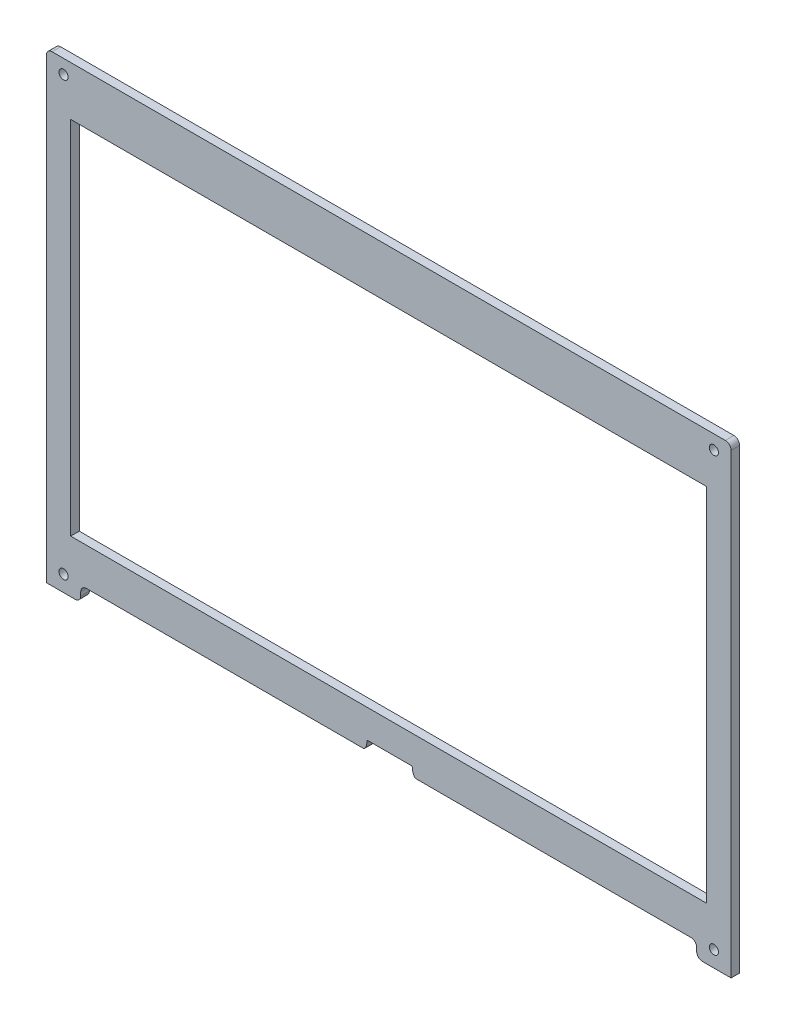
ISO-10303-21;
HEADER;
FILE_DESCRIPTION(('STEP AP214'),'2;1');
FILE_NAME('part.step','',(''),(''),'','','');
FILE_SCHEMA(('AUTOMOTIVE_DESIGN { 1 0 10303 214 1 1 1 1 }'));
ENDSEC;
DATA;
#1=APPLICATION_CONTEXT('core data for automotive mechanical design processes');
#2=APPLICATION_PROTOCOL_DEFINITION('international standard','automotive_design',2000,#1);
#3=PRODUCT_CONTEXT('',#1,'mechanical');
#4=PRODUCT('Part','Part','',(#3));
#5=PRODUCT_RELATED_PRODUCT_CATEGORY('part','',(#4));
#6=PRODUCT_DEFINITION_FORMATION('','',#4);
#7=PRODUCT_DEFINITION_CONTEXT('part definition',#1,'design');
#8=PRODUCT_DEFINITION('design','',#6,#7);
#9=PRODUCT_DEFINITION_SHAPE('','',#8);
#10=(LENGTH_UNIT() NAMED_UNIT(*) SI_UNIT(.MILLI.,.METRE.));
#11=(NAMED_UNIT(*) PLANE_ANGLE_UNIT() SI_UNIT($,.RADIAN.));
#12=(NAMED_UNIT(*) SI_UNIT($,.STERADIAN.) SOLID_ANGLE_UNIT());
#13=UNCERTAINTY_MEASURE_WITH_UNIT(LENGTH_MEASURE(1.E-05),#10,'distance_accuracy_value','');
#14=(GEOMETRIC_REPRESENTATION_CONTEXT(3) GLOBAL_UNCERTAINTY_ASSIGNED_CONTEXT((#13)) GLOBAL_UNIT_ASSIGNED_CONTEXT((#10,
#11,#12)) REPRESENTATION_CONTEXT('',''));
#15=CARTESIAN_POINT('',(0.,0.,0.));
#16=DIRECTION('',(0.,0.,1.));
#17=DIRECTION('',(1.,0.,0.));
#18=AXIS2_PLACEMENT_3D('',#15,#16,#17);
#19=CARTESIAN_POINT('',(0.,-61.264087445583,3.));
#20=DIRECTION('',(0.,1.,0.));
#21=DIRECTION('',(0.,0.,1.));
#22=AXIS2_PLACEMENT_3D('',#19,#20,#21);
#23=PLANE('',#22);
#24=DIRECTION('',(1.,0.,0.));
#25=VECTOR('',#24,1.);
#26=CARTESIAN_POINT('',(0.,-61.264087445583,0.));
#27=LINE('',#26,#25);
#28=CARTESIAN_POINT('',(-110.99866899052,-61.264087445583,0.));
#29=VERTEX_POINT('',#28);
#30=CARTESIAN_POINT('',(111.017027096704,-61.264087445583,0.));
#31=VERTEX_POINT('',#30);
#32=EDGE_CURVE('E333',#29,#31,#27,.T.);
#33=ORIENTED_EDGE('',*,*,#32,.F.);
#34=DIRECTION('',(0.,0.,-1.));
#35=VECTOR('',#34,1.);
#36=CARTESIAN_POINT('',(-110.99866899052,-61.264087445583,3.));
#37=LINE('',#36,#35);
#38=CARTESIAN_POINT('',(-110.99866899052,-61.264087445583,3.));
#39=VERTEX_POINT('',#38);
#40=EDGE_CURVE('E11',#39,#29,#37,.T.);
#41=ORIENTED_EDGE('',*,*,#40,.F.);
#42=DIRECTION('',(1.,0.,0.));
#43=VECTOR('',#42,1.);
#44=CARTESIAN_POINT('',(0.,-61.264087445583,3.));
#45=LINE('',#44,#43);
#46=CARTESIAN_POINT('',(111.017027096704,-61.264087445583,3.));
#47=VERTEX_POINT('',#46);
#48=EDGE_CURVE('E248',#39,#47,#45,.T.);
#49=ORIENTED_EDGE('',*,*,#48,.T.);
#50=DIRECTION('',(0.,0.,-1.));
#51=VECTOR('',#50,1.);
#52=CARTESIAN_POINT('',(111.017027096704,-61.264087445583,3.));
#53=LINE('',#52,#51);
#54=EDGE_CURVE('E149',#47,#31,#53,.T.);
#55=ORIENTED_EDGE('',*,*,#54,.T.);
#56=EDGE_LOOP('',(#33,#41,#49,#55));
#57=FACE_BOUND('',#56,.T.);
#58=ADVANCED_FACE('F35',(#57),#23,.T.);
#59=CARTESIAN_POINT('',(-110.99866899052,0.,3.));
#60=DIRECTION('',(1.,0.,0.));
#61=DIRECTION('',(0.,0.,-1.));
#62=AXIS2_PLACEMENT_3D('',#59,#60,#61);
#63=PLANE('',#62);
#64=DIRECTION('',(0.,-1.,0.));
#65=VECTOR('',#64,1.);
#66=CARTESIAN_POINT('',(-110.99866899052,0.,0.));
#67=LINE('',#66,#65);
#68=CARTESIAN_POINT('',(-110.99866899052,64.7082535301475,0.));
#69=VERTEX_POINT('',#68);
#70=EDGE_CURVE('E238',#69,#29,#67,.T.);
#71=ORIENTED_EDGE('',*,*,#70,.F.);
#72=DIRECTION('',(0.,0.,-1.));
#73=VECTOR('',#72,1.);
#74=CARTESIAN_POINT('',(-110.99866899052,64.7082535301475,3.));
#75=LINE('',#74,#73);
#76=CARTESIAN_POINT('',(-110.99866899052,64.7082535301475,3.));
#77=VERTEX_POINT('',#76);
#78=EDGE_CURVE('E45',#77,#69,#75,.T.);
#79=ORIENTED_EDGE('',*,*,#78,.F.);
#80=DIRECTION('',(0.,-1.,0.));
#81=VECTOR('',#80,1.);
#82=CARTESIAN_POINT('',(-110.99866899052,0.,3.));
#83=LINE('',#82,#81);
#84=EDGE_CURVE('E236',#77,#39,#83,.T.);
#85=ORIENTED_EDGE('',*,*,#84,.T.);
#86=ORIENTED_EDGE('',*,*,#40,.T.);
#87=EDGE_LOOP('',(#71,#79,#85,#86));
#88=FACE_BOUND('',#87,.T.);
#89=ADVANCED_FACE('F234',(#88),#63,.T.);
#90=CARTESIAN_POINT('',(0.,64.7082535301475,3.));
#91=DIRECTION('',(0.,1.,0.));
#92=DIRECTION('',(0.,0.,1.));
#93=AXIS2_PLACEMENT_3D('',#90,#91,#92);
#94=PLANE('',#93);
#95=DIRECTION('',(1.,0.,0.));
#96=VECTOR('',#95,1.);
#97=CARTESIAN_POINT('',(0.,64.7082535301475,0.));
#98=LINE('',#97,#96);
#99=CARTESIAN_POINT('',(111.017027096704,64.7082535301475,0.));
#100=VERTEX_POINT('',#99);
#101=EDGE_CURVE('E336',#69,#100,#98,.T.);
#102=ORIENTED_EDGE('',*,*,#101,.T.);
#103=DIRECTION('',(0.,0.,-1.));
#104=VECTOR('',#103,1.);
#105=CARTESIAN_POINT('',(111.017027096704,64.7082535301475,3.));
#106=LINE('',#105,#104);
#107=CARTESIAN_POINT('',(111.017027096704,64.7082535301475,3.));
#108=VERTEX_POINT('',#107);
#109=EDGE_CURVE('E241',#108,#100,#106,.T.);
#110=ORIENTED_EDGE('',*,*,#109,.F.);
#111=DIRECTION('',(1.,0.,0.));
#112=VECTOR('',#111,1.);
#113=CARTESIAN_POINT('',(0.,64.7082535301475,3.));
#114=LINE('',#113,#112);
#115=EDGE_CURVE('E244',#77,#108,#114,.T.);
#116=ORIENTED_EDGE('',*,*,#115,.F.);
#117=ORIENTED_EDGE('',*,*,#78,.T.);
#118=EDGE_LOOP('',(#102,#110,#116,#117));
#119=FACE_BOUND('',#118,.T.);
#120=ADVANCED_FACE('F245',(#119),#94,.F.);
#121=CARTESIAN_POINT('',(105.5,-76.3425603634929,3.));
#122=DIRECTION('',(0.,0.,-1.));
#123=DIRECTION('',(-1.,0.,0.));
#124=AXIS2_PLACEMENT_3D('',#121,#122,#123);
#125=CYLINDRICAL_SURFACE('',#124,2.);
#126=CARTESIAN_POINT('',(105.5,-76.3425603634929,0.));
#127=DIRECTION('',(0.,0.,1.));
#128=DIRECTION('',(1.,0.,0.));
#129=AXIS2_PLACEMENT_3D('',#126,#127,#128);
#130=CIRCLE('',#129,2.);
#131=CARTESIAN_POINT('',(105.5,-74.3425603634929,0.));
#132=VERTEX_POINT('',#131);
#133=CARTESIAN_POINT('',(107.5,-76.3425603634929,0.));
#134=VERTEX_POINT('',#133);
#135=EDGE_CURVE('E256',#132,#134,#130,.F.);
#136=ORIENTED_EDGE('',*,*,#135,.T.);
#137=DIRECTION('',(0.,0.,-1.));
#138=VECTOR('',#137,1.);
#139=CARTESIAN_POINT('',(107.5,-76.3425603634929,3.));
#140=LINE('',#139,#138);
#141=CARTESIAN_POINT('',(107.5,-76.3425603634929,3.));
#142=VERTEX_POINT('',#141);
#143=EDGE_CURVE('E39',#142,#134,#140,.T.);
#144=ORIENTED_EDGE('',*,*,#143,.F.);
#145=CARTESIAN_POINT('',(105.5,-76.3425603634929,3.));
#146=DIRECTION('',(0.,0.,1.));
#147=DIRECTION('',(1.,0.,0.));
#148=AXIS2_PLACEMENT_3D('',#145,#146,#147);
#149=CIRCLE('',#148,2.);
#150=CARTESIAN_POINT('',(105.5,-74.3425603634929,3.));
#151=VERTEX_POINT('',#150);
#152=EDGE_CURVE('E339',#151,#142,#149,.F.);
#153=ORIENTED_EDGE('',*,*,#152,.F.);
#154=DIRECTION('',(0.,0.,-1.));
#155=VECTOR('',#154,1.);
#156=CARTESIAN_POINT('',(105.5,-74.3425603634929,3.));
#157=LINE('',#156,#155);
#158=EDGE_CURVE('E255',#151,#132,#157,.T.);
#159=ORIENTED_EDGE('',*,*,#158,.T.);
#160=EDGE_LOOP('',(#136,#144,#153,#159));
#161=FACE_BOUND('',#160,.T.);
#162=ADVANCED_FACE('F37',(#161),#125,.F.);
#163=CARTESIAN_POINT('',(107.5,0.,3.));
#164=DIRECTION('',(1.,0.,0.));
#165=DIRECTION('',(0.,0.,-1.));
#166=AXIS2_PLACEMENT_3D('',#163,#164,#165);
#167=PLANE('',#166);
#168=DIRECTION('',(0.,-1.,0.));
#169=VECTOR('',#168,1.);
#170=CARTESIAN_POINT('',(107.5,0.,0.));
#171=LINE('',#170,#169);
#172=CARTESIAN_POINT('',(107.5,-77.5888337628124,0.));
#173=VERTEX_POINT('',#172);
#174=EDGE_CURVE('E259',#134,#173,#171,.T.);
#175=ORIENTED_EDGE('',*,*,#174,.T.);
#176=DIRECTION('',(0.,0.,-1.));
#177=VECTOR('',#176,1.);
#178=CARTESIAN_POINT('',(107.5,-77.5888337628124,3.));
#179=LINE('',#178,#177);
#180=CARTESIAN_POINT('',(107.5,-77.5888337628124,3.));
#181=VERTEX_POINT('',#180);
#182=EDGE_CURVE('E390',#181,#173,#179,.T.);
#183=ORIENTED_EDGE('',*,*,#182,.F.);
#184=DIRECTION('',(0.,-1.,0.));
#185=VECTOR('',#184,1.);
#186=CARTESIAN_POINT('',(107.5,0.,3.));
#187=LINE('',#186,#185);
#188=EDGE_CURVE('E157',#142,#181,#187,.T.);
#189=ORIENTED_EDGE('',*,*,#188,.F.);
#190=ORIENTED_EDGE('',*,*,#143,.T.);
#191=EDGE_LOOP('',(#175,#183,#189,#190));
#192=FACE_BOUND('',#191,.T.);
#193=ADVANCED_FACE('F396',(#192),#167,.F.);
#194=CARTESIAN_POINT('',(109.5,-77.5888337628124,3.));
#195=DIRECTION('',(0.,0.,-1.));
#196=DIRECTION('',(-1.,0.,0.));
#197=AXIS2_PLACEMENT_3D('',#194,#195,#196);
#198=CYLINDRICAL_SURFACE('',#197,2.);
#199=CARTESIAN_POINT('',(109.5,-77.5888337628124,0.));
#200=DIRECTION('',(0.,0.,1.));
#201=DIRECTION('',(1.,0.,0.));
#202=AXIS2_PLACEMENT_3D('',#199,#200,#201);
#203=CIRCLE('',#202,2.);
#204=CARTESIAN_POINT('',(109.5,-79.5888337628124,0.));
#205=VERTEX_POINT('',#204);
#206=EDGE_CURVE('E261',#173,#205,#203,.T.);
#207=ORIENTED_EDGE('',*,*,#206,.T.);
#208=DIRECTION('',(0.,0.,-1.));
#209=VECTOR('',#208,1.);
#210=CARTESIAN_POINT('',(109.5,-79.5888337628124,3.));
#211=LINE('',#210,#209);
#212=CARTESIAN_POINT('',(109.5,-79.5888337628124,3.));
#213=VERTEX_POINT('',#212);
#214=EDGE_CURVE('E389',#213,#205,#211,.T.);
#215=ORIENTED_EDGE('',*,*,#214,.F.);
#216=CARTESIAN_POINT('',(109.5,-77.5888337628124,3.));
#217=DIRECTION('',(0.,0.,1.));
#218=DIRECTION('',(1.,0.,0.));
#219=AXIS2_PLACEMENT_3D('',#216,#217,#218);
#220=CIRCLE('',#219,2.);
#221=EDGE_CURVE('E410',#181,#213,#220,.T.);
#222=ORIENTED_EDGE('',*,*,#221,.F.);
#223=ORIENTED_EDGE('',*,*,#182,.T.);
#224=EDGE_LOOP('',(#207,#215,#222,#223));
#225=FACE_BOUND('',#224,.T.);
#226=ADVANCED_FACE('F408',(#225),#198,.T.);
#227=CARTESIAN_POINT('',(0.,-79.5888337628124,3.));
#228=DIRECTION('',(0.,-1.,0.));
#229=DIRECTION('',(0.,0.,-1.));
#230=AXIS2_PLACEMENT_3D('',#227,#228,#229);
#231=PLANE('',#230);
#232=DIRECTION('',(-1.,0.,0.));
#233=VECTOR('',#232,1.);
#234=CARTESIAN_POINT('',(0.,-79.5888337628124,0.));
#235=LINE('',#234,#233);
#236=CARTESIAN_POINT('',(119.500003052676,-79.5888337628124,0.));
#237=VERTEX_POINT('',#236);
#238=EDGE_CURVE('E264',#237,#205,#235,.T.);
#239=ORIENTED_EDGE('',*,*,#238,.F.);
#240=DIRECTION('',(0.,0.,-1.));
#241=VECTOR('',#240,1.);
#242=CARTESIAN_POINT('',(119.500003052676,-79.5888337628124,3.));
#243=LINE('',#242,#241);
#244=CARTESIAN_POINT('',(119.500003052676,-79.5888337628124,3.));
#245=VERTEX_POINT('',#244);
#246=EDGE_CURVE('E387',#245,#237,#243,.T.);
#247=ORIENTED_EDGE('',*,*,#246,.F.);
#248=DIRECTION('',(-1.,0.,0.));
#249=VECTOR('',#248,1.);
#250=CARTESIAN_POINT('',(0.,-79.5888337628124,3.));
#251=LINE('',#250,#249);
#252=EDGE_CURVE('E413',#245,#213,#251,.T.);
#253=ORIENTED_EDGE('',*,*,#252,.T.);
#254=ORIENTED_EDGE('',*,*,#214,.T.);
#255=EDGE_LOOP('',(#239,#247,#253,#254));
#256=FACE_BOUND('',#255,.T.);
#257=ADVANCED_FACE('F414',(#256),#231,.T.);
#258=CARTESIAN_POINT('',(119.500003052676,0.,3.));
#259=DIRECTION('',(1.,0.,0.));
#260=DIRECTION('',(0.,0.,-1.));
#261=AXIS2_PLACEMENT_3D('',#258,#259,#260);
#262=PLANE('',#261);
#263=DIRECTION('',(0.,-1.,0.));
#264=VECTOR('',#263,1.);
#265=CARTESIAN_POINT('',(119.500003052676,0.,0.));
#266=LINE('',#265,#264);
#267=CARTESIAN_POINT('',(119.500003052676,79.9103462304699,0.));
#268=VERTEX_POINT('',#267);
#269=EDGE_CURVE('E267',#268,#237,#266,.T.);
#270=ORIENTED_EDGE('',*,*,#269,.F.);
#271=DIRECTION('',(0.,0.,-1.));
#272=VECTOR('',#271,1.);
#273=CARTESIAN_POINT('',(119.500003052676,79.9103462304699,3.));
#274=LINE('',#273,#272);
#275=CARTESIAN_POINT('',(119.500003052676,79.9103462304699,3.));
#276=VERTEX_POINT('',#275);
#277=EDGE_CURVE('E385',#276,#268,#274,.T.);
#278=ORIENTED_EDGE('',*,*,#277,.F.);
#279=DIRECTION('',(0.,-1.,0.));
#280=VECTOR('',#279,1.);
#281=CARTESIAN_POINT('',(119.500003052676,0.,3.));
#282=LINE('',#281,#280);
#283=EDGE_CURVE('E418',#276,#245,#282,.T.);
#284=ORIENTED_EDGE('',*,*,#283,.T.);
#285=ORIENTED_EDGE('',*,*,#246,.T.);
#286=EDGE_LOOP('',(#270,#278,#284,#285));
#287=FACE_BOUND('',#286,.T.);
#288=ADVANCED_FACE('F594',(#287),#262,.T.);
#289=CARTESIAN_POINT('',(117.494841083084,79.9103462304699,3.));
#290=DIRECTION('',(0.,0.,-1.));
#291=DIRECTION('',(-1.,0.,0.));
#292=AXIS2_PLACEMENT_3D('',#289,#290,#291);
#293=CYLINDRICAL_SURFACE('',#292,2.00516196959211);
#294=CARTESIAN_POINT('',(117.494841083084,79.9103462304699,0.));
#295=DIRECTION('',(0.,0.,1.));
#296=DIRECTION('',(1.,0.,0.));
#297=AXIS2_PLACEMENT_3D('',#294,#295,#296);
#298=CIRCLE('',#297,2.00516196959211);
#299=CARTESIAN_POINT('',(117.494826949063,81.9155082000122,0.));
#300=VERTEX_POINT('',#299);
#301=EDGE_CURVE('E270',#300,#268,#298,.F.);
#302=ORIENTED_EDGE('',*,*,#301,.F.);
#303=DIRECTION('',(0.,0.,-1.));
#304=VECTOR('',#303,1.);
#305=CARTESIAN_POINT('',(117.494826949063,81.9155082000122,3.));
#306=LINE('',#305,#304);
#307=CARTESIAN_POINT('',(117.494826949063,81.9155082000122,3.));
#308=VERTEX_POINT('',#307);
#309=EDGE_CURVE('E383',#308,#300,#306,.T.);
#310=ORIENTED_EDGE('',*,*,#309,.F.);
#311=CARTESIAN_POINT('',(117.494841083084,79.9103462304699,3.));
#312=DIRECTION('',(0.,0.,1.));
#313=DIRECTION('',(1.,0.,0.));
#314=AXIS2_PLACEMENT_3D('',#311,#312,#313);
#315=CIRCLE('',#314,2.00516196959211);
#316=EDGE_CURVE('E420',#308,#276,#315,.F.);
#317=ORIENTED_EDGE('',*,*,#316,.T.);
#318=ORIENTED_EDGE('',*,*,#277,.T.);
#319=EDGE_LOOP('',(#302,#310,#317,#318));
#320=FACE_BOUND('',#319,.T.);
#321=ADVANCED_FACE('F590',(#320),#293,.T.);
#322=CARTESIAN_POINT('',(-0.000577401628049426,81.9146799963524,3.));
#323=DIRECTION('',(-7.04881747765838E-06,0.999999999975157,0.));
#324=DIRECTION('',(-0.999999999975157,-7.04881747765838E-06,0.));
#325=AXIS2_PLACEMENT_3D('',#322,#323,#324);
#326=PLANE('',#325);
#327=DIRECTION('',(0.999999999975157,7.04881747765838E-06,0.));
#328=VECTOR('',#327,1.);
#329=CARTESIAN_POINT('',(-0.000577401628049426,81.9146799963524,0.));
#330=LINE('',#329,#328);
#331=CARTESIAN_POINT('',(-117.5,81.9138517643688,0.));
#332=VERTEX_POINT('',#331);
#333=EDGE_CURVE('E273',#332,#300,#330,.T.);
#334=ORIENTED_EDGE('',*,*,#333,.F.);
#335=DIRECTION('',(0.,0.,-1.));
#336=VECTOR('',#335,1.);
#337=CARTESIAN_POINT('',(-117.5,81.9138517643688,3.));
#338=LINE('',#337,#336);
#339=CARTESIAN_POINT('',(-117.5,81.9138517643688,3.));
#340=VERTEX_POINT('',#339);
#341=EDGE_CURVE('E381',#340,#332,#338,.T.);
#342=ORIENTED_EDGE('',*,*,#341,.F.);
#343=DIRECTION('',(0.999999999975157,7.04881747765838E-06,0.));
#344=VECTOR('',#343,1.);
#345=CARTESIAN_POINT('',(-0.000577401628049426,81.9146799963524,3.));
#346=LINE('',#345,#344);
#347=EDGE_CURVE('E427',#340,#308,#346,.T.);
#348=ORIENTED_EDGE('',*,*,#347,.T.);
#349=ORIENTED_EDGE('',*,*,#309,.T.);
#350=EDGE_LOOP('',(#334,#342,#348,#349));
#351=FACE_BOUND('',#350,.T.);
#352=ADVANCED_FACE('F586',(#351),#326,.T.);
#353=CARTESIAN_POINT('',(-117.5,79.9138517643688,3.));
#354=DIRECTION('',(0.,0.,-1.));
#355=DIRECTION('',(-1.,0.,0.));
#356=AXIS2_PLACEMENT_3D('',#353,#354,#355);
#357=CYLINDRICAL_SURFACE('',#356,2.);
#358=CARTESIAN_POINT('',(-117.5,79.9138517643688,0.));
#359=DIRECTION('',(0.,0.,1.));
#360=DIRECTION('',(1.,0.,0.));
#361=AXIS2_PLACEMENT_3D('',#358,#359,#360);
#362=CIRCLE('',#361,2.);
#363=CARTESIAN_POINT('',(-119.5,79.9138517643688,0.));
#364=VERTEX_POINT('',#363);
#365=EDGE_CURVE('E276',#364,#332,#362,.F.);
#366=ORIENTED_EDGE('',*,*,#365,.F.);
#367=DIRECTION('',(0.,0.,-1.));
#368=VECTOR('',#367,1.);
#369=CARTESIAN_POINT('',(-119.5,79.9138517643688,3.));
#370=LINE('',#369,#368);
#371=CARTESIAN_POINT('',(-119.5,79.9138517643688,3.));
#372=VERTEX_POINT('',#371);
#373=EDGE_CURVE('E379',#372,#364,#370,.T.);
#374=ORIENTED_EDGE('',*,*,#373,.F.);
#375=CARTESIAN_POINT('',(-117.5,79.9138517643688,3.));
#376=DIRECTION('',(0.,0.,1.));
#377=DIRECTION('',(1.,0.,0.));
#378=AXIS2_PLACEMENT_3D('',#375,#376,#377);
#379=CIRCLE('',#378,2.);
#380=EDGE_CURVE('E430',#372,#340,#379,.F.);
#381=ORIENTED_EDGE('',*,*,#380,.T.);
#382=ORIENTED_EDGE('',*,*,#341,.T.);
#383=EDGE_LOOP('',(#366,#374,#381,#382));
#384=FACE_BOUND('',#383,.T.);
#385=ADVANCED_FACE('F582',(#384),#357,.T.);
#386=CARTESIAN_POINT('',(-119.5,0.,3.));
#387=DIRECTION('',(1.,0.,0.));
#388=DIRECTION('',(0.,0.,-1.));
#389=AXIS2_PLACEMENT_3D('',#386,#387,#388);
#390=PLANE('',#389);
#391=DIRECTION('',(0.,-1.,0.));
#392=VECTOR('',#391,1.);
#393=CARTESIAN_POINT('',(-119.5,0.,0.));
#394=LINE('',#393,#392);
#395=CARTESIAN_POINT('',(-119.5,-79.5888337628125,0.));
#396=VERTEX_POINT('',#395);
#397=EDGE_CURVE('E279',#364,#396,#394,.T.);
#398=ORIENTED_EDGE('',*,*,#397,.T.);
#399=DIRECTION('',(0.,0.,-1.));
#400=VECTOR('',#399,1.);
#401=CARTESIAN_POINT('',(-119.5,-79.5888337628125,3.));
#402=LINE('',#401,#400);
#403=CARTESIAN_POINT('',(-119.5,-79.5888337628125,3.));
#404=VERTEX_POINT('',#403);
#405=EDGE_CURVE('E376',#404,#396,#402,.T.);
#406=ORIENTED_EDGE('',*,*,#405,.F.);
#407=DIRECTION('',(0.,-1.,0.));
#408=VECTOR('',#407,1.);
#409=CARTESIAN_POINT('',(-119.5,0.,3.));
#410=LINE('',#409,#408);
#411=EDGE_CURVE('E433',#372,#404,#410,.T.);
#412=ORIENTED_EDGE('',*,*,#411,.F.);
#413=ORIENTED_EDGE('',*,*,#373,.T.);
#414=EDGE_LOOP('',(#398,#406,#412,#413));
#415=FACE_BOUND('',#414,.T.);
#416=ADVANCED_FACE('F578',(#415),#390,.F.);
#417=CARTESIAN_POINT('',(0.,-79.5888337628125,3.));
#418=DIRECTION('',(0.,1.,0.));
#419=DIRECTION('',(0.,0.,1.));
#420=AXIS2_PLACEMENT_3D('',#417,#418,#419);
#421=PLANE('',#420);
#422=DIRECTION('',(1.,0.,0.));
#423=VECTOR('',#422,1.);
#424=CARTESIAN_POINT('',(0.,-79.5888337628125,0.));
#425=LINE('',#424,#423);
#426=CARTESIAN_POINT('',(-109.5,-79.5888337628125,0.));
#427=VERTEX_POINT('',#426);
#428=EDGE_CURVE('E281',#396,#427,#425,.T.);
#429=ORIENTED_EDGE('',*,*,#428,.T.);
#430=DIRECTION('',(0.,0.,-1.));
#431=VECTOR('',#430,1.);
#432=CARTESIAN_POINT('',(-109.5,-79.5888337628125,3.));
#433=LINE('',#432,#431);
#434=CARTESIAN_POINT('',(-109.5,-79.5888337628125,3.));
#435=VERTEX_POINT('',#434);
#436=EDGE_CURVE('E373',#435,#427,#433,.T.);
#437=ORIENTED_EDGE('',*,*,#436,.F.);
#438=DIRECTION('',(1.,0.,0.));
#439=VECTOR('',#438,1.);
#440=CARTESIAN_POINT('',(0.,-79.5888337628125,3.));
#441=LINE('',#440,#439);
#442=EDGE_CURVE('E435',#404,#435,#441,.T.);
#443=ORIENTED_EDGE('',*,*,#442,.F.);
#444=ORIENTED_EDGE('',*,*,#405,.T.);
#445=EDGE_LOOP('',(#429,#437,#443,#444));
#446=FACE_BOUND('',#445,.T.);
#447=ADVANCED_FACE('F574',(#446),#421,.F.);
#448=CARTESIAN_POINT('',(-109.5,-77.5888337628125,3.));
#449=DIRECTION('',(0.,0.,-1.));
#450=DIRECTION('',(-1.,0.,0.));
#451=AXIS2_PLACEMENT_3D('',#448,#449,#450);
#452=CYLINDRICAL_SURFACE('',#451,2.);
#453=CARTESIAN_POINT('',(-109.5,-77.5888337628125,0.));
#454=DIRECTION('',(0.,0.,1.));
#455=DIRECTION('',(1.,0.,0.));
#456=AXIS2_PLACEMENT_3D('',#453,#454,#455);
#457=CIRCLE('',#456,2.);
#458=CARTESIAN_POINT('',(-107.5,-77.5888337628125,0.));
#459=VERTEX_POINT('',#458);
#460=EDGE_CURVE('E283',#427,#459,#457,.T.);
#461=ORIENTED_EDGE('',*,*,#460,.T.);
#462=DIRECTION('',(0.,0.,-1.));
#463=VECTOR('',#462,1.);
#464=CARTESIAN_POINT('',(-107.5,-77.5888337628125,3.));
#465=LINE('',#464,#463);
#466=CARTESIAN_POINT('',(-107.5,-77.5888337628125,3.));
#467=VERTEX_POINT('',#466);
#468=EDGE_CURVE('E371',#467,#459,#465,.T.);
#469=ORIENTED_EDGE('',*,*,#468,.F.);
#470=CARTESIAN_POINT('',(-109.5,-77.5888337628125,3.));
#471=DIRECTION('',(0.,0.,1.));
#472=DIRECTION('',(1.,0.,0.));
#473=AXIS2_PLACEMENT_3D('',#470,#471,#472);
#474=CIRCLE('',#473,2.);
#475=EDGE_CURVE('E437',#435,#467,#474,.T.);
#476=ORIENTED_EDGE('',*,*,#475,.F.);
#477=ORIENTED_EDGE('',*,*,#436,.T.);
#478=EDGE_LOOP('',(#461,#469,#476,#477));
#479=FACE_BOUND('',#478,.T.);
#480=ADVANCED_FACE('F570',(#479),#452,.T.);
#481=CARTESIAN_POINT('',(-107.5,0.,3.));
#482=DIRECTION('',(1.,0.,0.));
#483=DIRECTION('',(0.,0.,-1.));
#484=AXIS2_PLACEMENT_3D('',#481,#482,#483);
#485=PLANE('',#484);
#486=DIRECTION('',(0.,-1.,0.));
#487=VECTOR('',#486,1.);
#488=CARTESIAN_POINT('',(-107.5,0.,0.));
#489=LINE('',#488,#487);
#490=CARTESIAN_POINT('',(-107.5,-76.3425603634929,0.));
#491=VERTEX_POINT('',#490);
#492=EDGE_CURVE('E286',#491,#459,#489,.T.);
#493=ORIENTED_EDGE('',*,*,#492,.F.);
#494=DIRECTION('',(0.,0.,-1.));
#495=VECTOR('',#494,1.);
#496=CARTESIAN_POINT('',(-107.5,-76.3425603634929,3.));
#497=LINE('',#496,#495);
#498=CARTESIAN_POINT('',(-107.5,-76.3425603634929,3.));
#499=VERTEX_POINT('',#498);
#500=EDGE_CURVE('E369',#499,#491,#497,.T.);
#501=ORIENTED_EDGE('',*,*,#500,.F.);
#502=DIRECTION('',(0.,-1.,0.));
#503=VECTOR('',#502,1.);
#504=CARTESIAN_POINT('',(-107.5,0.,3.));
#505=LINE('',#504,#503);
#506=EDGE_CURVE('E439',#499,#467,#505,.T.);
#507=ORIENTED_EDGE('',*,*,#506,.T.);
#508=ORIENTED_EDGE('',*,*,#468,.T.);
#509=EDGE_LOOP('',(#493,#501,#507,#508));
#510=FACE_BOUND('',#509,.T.);
#511=ADVANCED_FACE('F566',(#510),#485,.T.);
#512=CARTESIAN_POINT('',(-105.5,-76.3425603634929,3.));
#513=DIRECTION('',(0.,0.,-1.));
#514=DIRECTION('',(-1.,0.,0.));
#515=AXIS2_PLACEMENT_3D('',#512,#513,#514);
#516=CYLINDRICAL_SURFACE('',#515,2.);
#517=CARTESIAN_POINT('',(-105.5,-76.3425603634929,0.));
#518=DIRECTION('',(0.,0.,1.));
#519=DIRECTION('',(1.,0.,0.));
#520=AXIS2_PLACEMENT_3D('',#517,#518,#519);
#521=CIRCLE('',#520,2.);
#522=CARTESIAN_POINT('',(-105.5,-74.3425603634929,0.));
#523=VERTEX_POINT('',#522);
#524=EDGE_CURVE('E289',#523,#491,#521,.T.);
#525=ORIENTED_EDGE('',*,*,#524,.F.);
#526=DIRECTION('',(0.,0.,-1.));
#527=VECTOR('',#526,1.);
#528=CARTESIAN_POINT('',(-105.5,-74.3425603634929,3.));
#529=LINE('',#528,#527);
#530=CARTESIAN_POINT('',(-105.5,-74.3425603634929,3.));
#531=VERTEX_POINT('',#530);
#532=EDGE_CURVE('E367',#531,#523,#529,.T.);
#533=ORIENTED_EDGE('',*,*,#532,.F.);
#534=CARTESIAN_POINT('',(-105.5,-76.3425603634929,3.));
#535=DIRECTION('',(0.,0.,1.));
#536=DIRECTION('',(1.,0.,0.));
#537=AXIS2_PLACEMENT_3D('',#534,#535,#536);
#538=CIRCLE('',#537,2.);
#539=EDGE_CURVE('E442',#531,#499,#538,.T.);
#540=ORIENTED_EDGE('',*,*,#539,.T.);
#541=ORIENTED_EDGE('',*,*,#500,.T.);
#542=EDGE_LOOP('',(#525,#533,#540,#541));
#543=FACE_BOUND('',#542,.T.);
#544=ADVANCED_FACE('F562',(#543),#516,.F.);
#545=CARTESIAN_POINT('',(0.,-74.3425603634928,3.));
#546=DIRECTION('',(0.,-1.,0.));
#547=DIRECTION('',(1.,0.,0.));
#548=AXIS2_PLACEMENT_3D('',#545,#546,#547);
#549=PLANE('',#548);
#550=DIRECTION('',(-1.,0.,0.));
#551=VECTOR('',#550,1.);
#552=CARTESIAN_POINT('',(0.,-74.3425603634928,0.));
#553=LINE('',#552,#551);
#554=CARTESIAN_POINT('',(-8.82607722568258,-74.3425603634928,0.));
#555=VERTEX_POINT('',#554);
#556=EDGE_CURVE('E292',#555,#523,#553,.T.);
#557=ORIENTED_EDGE('',*,*,#556,.F.);
#558=DIRECTION('',(0.,0.,-1.));
#559=VECTOR('',#558,1.);
#560=CARTESIAN_POINT('',(-8.82607722568258,-74.3425603634928,3.));
#561=LINE('',#560,#559);
#562=CARTESIAN_POINT('',(-8.82607722568258,-74.3425603634928,3.));
#563=VERTEX_POINT('',#562);
#564=EDGE_CURVE('E365',#563,#555,#561,.T.);
#565=ORIENTED_EDGE('',*,*,#564,.F.);
#566=DIRECTION('',(-1.,0.,0.));
#567=VECTOR('',#566,1.);
#568=CARTESIAN_POINT('',(0.,-74.3425603634928,3.));
#569=LINE('',#568,#567);
#570=EDGE_CURVE('E445',#563,#531,#569,.T.);
#571=ORIENTED_EDGE('',*,*,#570,.T.);
#572=ORIENTED_EDGE('',*,*,#532,.T.);
#573=EDGE_LOOP('',(#557,#565,#571,#572));
#574=FACE_BOUND('',#573,.T.);
#575=ADVANCED_FACE('F558',(#574),#549,.T.);
#576=CARTESIAN_POINT('',(-8.82603130241022,-73.8425603656018,3.));
#577=DIRECTION('',(0.,0.,-1.));
#578=DIRECTION('',(-1.,0.,0.));
#579=AXIS2_PLACEMENT_3D('',#576,#577,#578);
#580=CYLINDRICAL_SURFACE('',#579,0.499999999999981);
#581=CARTESIAN_POINT('',(-8.82603130241022,-73.8425603656018,0.));
#582=DIRECTION('',(0.,0.,1.));
#583=DIRECTION('',(1.,0.,0.));
#584=AXIS2_PLACEMENT_3D('',#581,#582,#583);
#585=CIRCLE('',#584,0.499999999999981);
#586=CARTESIAN_POINT('',(-8.46060935793576,-74.1838326945364,0.));
#587=VERTEX_POINT('',#586);
#588=EDGE_CURVE('E295',#587,#555,#585,.F.);
#589=ORIENTED_EDGE('',*,*,#588,.F.);
#590=DIRECTION('',(0.,0.,-1.));
#591=VECTOR('',#590,1.);
#592=CARTESIAN_POINT('',(-8.46060935793576,-74.1838326945364,3.));
#593=LINE('',#592,#591);
#594=CARTESIAN_POINT('',(-8.46060935793576,-74.1838326945364,3.));
#595=VERTEX_POINT('',#594);
#596=EDGE_CURVE('E363',#595,#587,#593,.T.);
#597=ORIENTED_EDGE('',*,*,#596,.F.);
#598=CARTESIAN_POINT('',(-8.82603130241022,-73.8425603656018,3.));
#599=DIRECTION('',(0.,0.,1.));
#600=DIRECTION('',(1.,0.,0.));
#601=AXIS2_PLACEMENT_3D('',#598,#599,#600);
#602=CIRCLE('',#601,0.499999999999981);
#603=EDGE_CURVE('E448',#595,#563,#602,.F.);
#604=ORIENTED_EDGE('',*,*,#603,.T.);
#605=ORIENTED_EDGE('',*,*,#564,.T.);
#606=EDGE_LOOP('',(#589,#597,#604,#605));
#607=FACE_BOUND('',#606,.T.);
#608=ADVANCED_FACE('F554',(#607),#580,.T.);
#609=CARTESIAN_POINT('',(-10.633710479812,-72.1543451607771,3.));
#610=DIRECTION('',(0.,0.,-1.));
#611=DIRECTION('',(-1.,0.,0.));
#612=AXIS2_PLACEMENT_3D('',#609,#610,#611);
#613=CYLINDRICAL_SURFACE('',#612,2.9734135493712);
#614=CARTESIAN_POINT('',(-10.633710479812,-72.1543451607771,0.));
#615=DIRECTION('',(0.,0.,1.));
#616=DIRECTION('',(1.,0.,0.));
#617=AXIS2_PLACEMENT_3D('',#614,#615,#616);
#618=CIRCLE('',#617,2.9734135493712);
#619=CARTESIAN_POINT('',(-7.66137115746673,-72.2342644226863,0.));
#620=VERTEX_POINT('',#619);
#621=EDGE_CURVE('E298',#620,#587,#618,.F.);
#622=ORIENTED_EDGE('',*,*,#621,.F.);
#623=DIRECTION('',(0.,0.,-1.));
#624=VECTOR('',#623,1.);
#625=CARTESIAN_POINT('',(-7.66137115746673,-72.2342644226863,3.));
#626=LINE('',#625,#624);
#627=CARTESIAN_POINT('',(-7.66137115746673,-72.2342644226863,3.));
#628=VERTEX_POINT('',#627);
#629=EDGE_CURVE('E361',#628,#620,#626,.T.);
#630=ORIENTED_EDGE('',*,*,#629,.F.);
#631=CARTESIAN_POINT('',(-10.633710479812,-72.1543451607771,3.));
#632=DIRECTION('',(0.,0.,1.));
#633=DIRECTION('',(1.,0.,0.));
#634=AXIS2_PLACEMENT_3D('',#631,#632,#633);
#635=CIRCLE('',#634,2.9734135493712);
#636=EDGE_CURVE('E451',#628,#595,#635,.F.);
#637=ORIENTED_EDGE('',*,*,#636,.T.);
#638=ORIENTED_EDGE('',*,*,#596,.T.);
#639=EDGE_LOOP('',(#622,#630,#637,#638));
#640=FACE_BOUND('',#639,.T.);
#641=ADVANCED_FACE('F550',(#640),#613,.T.);
#642=CARTESIAN_POINT('',(-7.58675748051998,0.00783581692458199,3.));
#643=DIRECTION('',(-0.999999466633401,0.00103282762963472,0.));
#644=DIRECTION('',(-0.00103282762963473,-0.999999466633402,0.));
#645=AXIS2_PLACEMENT_3D('',#642,#643,#644);
#646=PLANE('',#645);
#647=DIRECTION('',(0.00103282762963473,0.999999466633402,0.));
#648=VECTOR('',#647,1.);
#649=CARTESIAN_POINT('',(-7.58675748051998,0.00783581692458199,0.));
#650=LINE('',#649,#648);
#651=CARTESIAN_POINT('',(-7.66081281116421,-71.6936650150983,0.));
#652=VERTEX_POINT('',#651);
#653=EDGE_CURVE('E301',#620,#652,#650,.T.);
#654=ORIENTED_EDGE('',*,*,#653,.T.);
#655=DIRECTION('',(0.,0.,-1.));
#656=VECTOR('',#655,1.);
#657=CARTESIAN_POINT('',(-7.66081281116421,-71.6936650150983,3.));
#658=LINE('',#657,#656);
#659=CARTESIAN_POINT('',(-7.66081281116421,-71.6936650150983,3.));
#660=VERTEX_POINT('',#659);
#661=EDGE_CURVE('E358',#660,#652,#658,.T.);
#662=ORIENTED_EDGE('',*,*,#661,.F.);
#663=DIRECTION('',(0.00103282762963473,0.999999466633402,0.));
#664=VECTOR('',#663,1.);
#665=CARTESIAN_POINT('',(-7.58675748051998,0.00783581692458199,3.));
#666=LINE('',#665,#664);
#667=EDGE_CURVE('E454',#628,#660,#666,.T.);
#668=ORIENTED_EDGE('',*,*,#667,.F.);
#669=ORIENTED_EDGE('',*,*,#629,.T.);
#670=EDGE_LOOP('',(#654,#662,#668,#669));
#671=FACE_BOUND('',#670,.T.);
#672=ADVANCED_FACE('F546',(#671),#646,.F.);
#673=CARTESIAN_POINT('',(-7.16081307784746,-71.694181428913,3.));
#674=DIRECTION('',(0.,0.,-1.));
#675=DIRECTION('',(-1.,0.,0.));
#676=AXIS2_PLACEMENT_3D('',#673,#674,#675);
#677=CYLINDRICAL_SURFACE('',#676,0.499999999999969);
#678=CARTESIAN_POINT('',(-7.16081307784746,-71.694181428913,0.));
#679=DIRECTION('',(0.,0.,1.));
#680=DIRECTION('',(1.,0.,0.));
#681=AXIS2_PLACEMENT_3D('',#678,#679,#680);
#682=CIRCLE('',#681,0.499999999999969);
#683=CARTESIAN_POINT('',(-7.16081307784756,-71.1941814289132,0.));
#684=VERTEX_POINT('',#683);
#685=EDGE_CURVE('E303',#652,#684,#682,.F.);
#686=ORIENTED_EDGE('',*,*,#685,.T.);
#687=DIRECTION('',(0.,0.,-1.));
#688=VECTOR('',#687,1.);
#689=CARTESIAN_POINT('',(-7.16081307784756,-71.1941814289132,3.));
#690=LINE('',#689,#688);
#691=CARTESIAN_POINT('',(-7.16081307784756,-71.1941814289132,3.));
#692=VERTEX_POINT('',#691);
#693=EDGE_CURVE('E355',#692,#684,#690,.T.);
#694=ORIENTED_EDGE('',*,*,#693,.F.);
#695=CARTESIAN_POINT('',(-7.16081307784746,-71.694181428913,3.));
#696=DIRECTION('',(0.,0.,1.));
#697=DIRECTION('',(1.,0.,0.));
#698=AXIS2_PLACEMENT_3D('',#695,#696,#697);
#699=CIRCLE('',#698,0.499999999999969);
#700=EDGE_CURVE('E456',#660,#692,#699,.F.);
#701=ORIENTED_EDGE('',*,*,#700,.F.);
#702=ORIENTED_EDGE('',*,*,#661,.T.);
#703=EDGE_LOOP('',(#686,#694,#701,#702));
#704=FACE_BOUND('',#703,.T.);
#705=ADVANCED_FACE('F542',(#704),#677,.F.);
#706=CARTESIAN_POINT('',(2.63471398139063E-13,-71.1941814289131,3.));
#707=DIRECTION('',(0.,1.,0.));
#708=DIRECTION('',(-1.,0.,0.));
#709=AXIS2_PLACEMENT_3D('',#706,#707,#708);
#710=PLANE('',#709);
#711=DIRECTION('',(1.,0.,0.));
#712=VECTOR('',#711,1.);
#713=CARTESIAN_POINT('',(2.63471398139063E-13,-71.1941814289131,0.));
#714=LINE('',#713,#712);
#715=CARTESIAN_POINT('',(7.83918692215267,-71.1941814289131,0.));
#716=VERTEX_POINT('',#715);
#717=EDGE_CURVE('E305',#684,#716,#714,.T.);
#718=ORIENTED_EDGE('',*,*,#717,.T.);
#719=DIRECTION('',(0.,0.,-1.));
#720=VECTOR('',#719,1.);
#721=CARTESIAN_POINT('',(7.83918692215267,-71.1941814289131,3.));
#722=LINE('',#721,#720);
#723=CARTESIAN_POINT('',(7.83918692215267,-71.1941814289131,3.));
#724=VERTEX_POINT('',#723);
#725=EDGE_CURVE('E353',#724,#716,#722,.T.);
#726=ORIENTED_EDGE('',*,*,#725,.F.);
#727=DIRECTION('',(1.,0.,0.));
#728=VECTOR('',#727,1.);
#729=CARTESIAN_POINT('',(2.63471398139063E-13,-71.1941814289131,3.));
#730=LINE('',#729,#728);
#731=EDGE_CURVE('E458',#692,#724,#730,.T.);
#732=ORIENTED_EDGE('',*,*,#731,.F.);
#733=ORIENTED_EDGE('',*,*,#693,.T.);
#734=EDGE_LOOP('',(#718,#726,#732,#733));
#735=FACE_BOUND('',#734,.T.);
#736=ADVANCED_FACE('F538',(#735),#710,.F.);
#737=CARTESIAN_POINT('',(7.83918692215267,-71.694181428913,3.));
#738=DIRECTION('',(0.,0.,-1.));
#739=DIRECTION('',(-1.,0.,0.));
#740=AXIS2_PLACEMENT_3D('',#737,#738,#739);
#741=CYLINDRICAL_SURFACE('',#740,0.499999999999921);
#742=CARTESIAN_POINT('',(7.83918692215267,-71.694181428913,0.));
#743=DIRECTION('',(0.,0.,1.));
#744=DIRECTION('',(1.,0.,0.));
#745=AXIS2_PLACEMENT_3D('',#742,#743,#744);
#746=CIRCLE('',#745,0.499999999999921);
#747=CARTESIAN_POINT('',(8.33918665546929,-71.6936650150983,0.));
#748=VERTEX_POINT('',#747);
#749=EDGE_CURVE('E308',#748,#716,#746,.T.);
#750=ORIENTED_EDGE('',*,*,#749,.F.);
#751=DIRECTION('',(0.,0.,-1.));
#752=VECTOR('',#751,1.);
#753=CARTESIAN_POINT('',(8.33918665546929,-71.6936650150983,3.));
#754=LINE('',#753,#752);
#755=CARTESIAN_POINT('',(8.33918665546929,-71.6936650150983,3.));
#756=VERTEX_POINT('',#755);
#757=EDGE_CURVE('E351',#756,#748,#754,.T.);
#758=ORIENTED_EDGE('',*,*,#757,.F.);
#759=CARTESIAN_POINT('',(7.83918692215267,-71.694181428913,3.));
#760=DIRECTION('',(0.,0.,1.));
#761=DIRECTION('',(1.,0.,0.));
#762=AXIS2_PLACEMENT_3D('',#759,#760,#761);
#763=CIRCLE('',#762,0.499999999999921);
#764=EDGE_CURVE('E460',#756,#724,#763,.T.);
#765=ORIENTED_EDGE('',*,*,#764,.T.);
#766=ORIENTED_EDGE('',*,*,#725,.T.);
#767=EDGE_LOOP('',(#750,#758,#765,#766));
#768=FACE_BOUND('',#767,.T.);
#769=ADVANCED_FACE('F534',(#768),#741,.F.);
#770=CARTESIAN_POINT('',(8.41946039034075,-0.00942831453947448,3.));
#771=DIRECTION('',(0.999999372997597,-0.00111982338425337,0.));
#772=DIRECTION('',(0.00111982338425337,0.999999372997598,0.));
#773=AXIS2_PLACEMENT_3D('',#770,#771,#772);
#774=PLANE('',#773);
#775=DIRECTION('',(-0.00111982338425337,-0.999999372997598,0.));
#776=VECTOR('',#775,1.);
#777=CARTESIAN_POINT('',(8.41946039034075,-0.00942831453947448,0.));
#778=LINE('',#777,#776);
#779=CARTESIAN_POINT('',(8.33867077474604,-72.1543451607771,0.));
#780=VERTEX_POINT('',#779);
#781=EDGE_CURVE('E311',#748,#780,#778,.T.);
#782=ORIENTED_EDGE('',*,*,#781,.T.);
#783=DIRECTION('',(0.,0.,-1.));
#784=VECTOR('',#783,1.);
#785=CARTESIAN_POINT('',(8.33867077474604,-72.1543451607771,3.));
#786=LINE('',#785,#784);
#787=CARTESIAN_POINT('',(8.33867077474604,-72.1543451607771,3.));
#788=VERTEX_POINT('',#787);
#789=EDGE_CURVE('E348',#788,#780,#786,.T.);
#790=ORIENTED_EDGE('',*,*,#789,.F.);
#791=DIRECTION('',(-0.00111982338425337,-0.999999372997598,0.));
#792=VECTOR('',#791,1.);
#793=CARTESIAN_POINT('',(8.41946039034075,-0.00942831453947448,3.));
#794=LINE('',#793,#792);
#795=EDGE_CURVE('E463',#756,#788,#794,.T.);
#796=ORIENTED_EDGE('',*,*,#795,.F.);
#797=ORIENTED_EDGE('',*,*,#757,.T.);
#798=EDGE_LOOP('',(#782,#790,#796,#797));
#799=FACE_BOUND('',#798,.T.);
#800=ADVANCED_FACE('F530',(#799),#774,.F.);
#801=CARTESIAN_POINT('',(11.3120843241172,-72.1543451607771,3.));
#802=DIRECTION('',(0.,0.,-1.));
#803=DIRECTION('',(-1.,0.,0.));
#804=AXIS2_PLACEMENT_3D('',#801,#802,#803);
#805=CYLINDRICAL_SURFACE('',#804,2.97341354937126);
#806=CARTESIAN_POINT('',(11.3120843241172,-72.1543451607771,0.));
#807=DIRECTION('',(0.,0.,1.));
#808=DIRECTION('',(1.,0.,0.));
#809=AXIS2_PLACEMENT_3D('',#806,#807,#808);
#810=CIRCLE('',#809,2.97341354937126);
#811=CARTESIAN_POINT('',(9.14078051557126,-74.1857554853,0.));
#812=VERTEX_POINT('',#811);
#813=EDGE_CURVE('E313',#780,#812,#810,.T.);
#814=ORIENTED_EDGE('',*,*,#813,.T.);
#815=DIRECTION('',(0.,0.,-1.));
#816=VECTOR('',#815,1.);
#817=CARTESIAN_POINT('',(9.14078051557126,-74.1857554853,3.));
#818=LINE('',#817,#816);
#819=CARTESIAN_POINT('',(9.14078051557126,-74.1857554853,3.));
#820=VERTEX_POINT('',#819);
#821=EDGE_CURVE('E346',#820,#812,#818,.T.);
#822=ORIENTED_EDGE('',*,*,#821,.F.);
#823=CARTESIAN_POINT('',(11.3120843241172,-72.1543451607771,3.));
#824=DIRECTION('',(0.,0.,1.));
#825=DIRECTION('',(1.,0.,0.));
#826=AXIS2_PLACEMENT_3D('',#823,#824,#825);
#827=CIRCLE('',#826,2.97341354937126);
#828=EDGE_CURVE('E465',#788,#820,#827,.T.);
#829=ORIENTED_EDGE('',*,*,#828,.F.);
#830=ORIENTED_EDGE('',*,*,#789,.T.);
#831=EDGE_LOOP('',(#814,#822,#829,#830));
#832=FACE_BOUND('',#831,.T.);
#833=ADVANCED_FACE('F526',(#832),#805,.T.);
#834=CARTESIAN_POINT('',(9.50590022941067,-73.8441598258344,3.));
#835=DIRECTION('',(0.,0.,-1.));
#836=DIRECTION('',(-1.,0.,0.));
#837=AXIS2_PLACEMENT_3D('',#834,#835,#836);
#838=CYLINDRICAL_SURFACE('',#837,0.499999999999989);
#839=CARTESIAN_POINT('',(9.50590022941067,-73.8441598258344,0.));
#840=DIRECTION('',(0.,0.,1.));
#841=DIRECTION('',(1.,0.,0.));
#842=AXIS2_PLACEMENT_3D('',#839,#840,#841);
#843=CIRCLE('',#842,0.499999999999989);
#844=CARTESIAN_POINT('',(9.46593894737657,-74.3425603634929,0.));
#845=VERTEX_POINT('',#844);
#846=EDGE_CURVE('E316',#845,#812,#843,.F.);
#847=ORIENTED_EDGE('',*,*,#846,.F.);
#848=DIRECTION('',(0.,0.,-1.));
#849=VECTOR('',#848,1.);
#850=CARTESIAN_POINT('',(9.46593894737657,-74.3425603634929,3.));
#851=LINE('',#850,#849);
#852=CARTESIAN_POINT('',(9.46593894737657,-74.3425603634929,3.));
#853=VERTEX_POINT('',#852);
#854=EDGE_CURVE('E344',#853,#845,#851,.T.);
#855=ORIENTED_EDGE('',*,*,#854,.F.);
#856=CARTESIAN_POINT('',(9.50590022941067,-73.8441598258344,3.));
#857=DIRECTION('',(0.,0.,1.));
#858=DIRECTION('',(1.,0.,0.));
#859=AXIS2_PLACEMENT_3D('',#856,#857,#858);
#860=CIRCLE('',#859,0.499999999999989);
#861=EDGE_CURVE('E467',#853,#820,#860,.F.);
#862=ORIENTED_EDGE('',*,*,#861,.T.);
#863=ORIENTED_EDGE('',*,*,#821,.T.);
#864=EDGE_LOOP('',(#847,#855,#862,#863));
#865=FACE_BOUND('',#864,.T.);
#866=ADVANCED_FACE('F509',(#865),#838,.T.);
#867=CARTESIAN_POINT('',(-113.5,77.0142786927077,3.));
#868=DIRECTION('',(0.,0.,-1.));
#869=DIRECTION('',(-1.,0.,0.));
#870=AXIS2_PLACEMENT_3D('',#867,#868,#869);
#871=CYLINDRICAL_SURFACE('',#870,1.59999999999992);
#872=CARTESIAN_POINT('',(-113.5,77.0142786927077,3.));
#873=DIRECTION('',(0.,0.,1.));
#874=DIRECTION('',(1.,0.,0.));
#875=AXIS2_PLACEMENT_3D('',#872,#873,#874);
#876=CIRCLE('',#875,1.59999999999992);
#877=CARTESIAN_POINT('',(-111.9,77.0142786927077,3.));
#878=VERTEX_POINT('',#877);
#879=EDGE_CURVE('E250',#878,#878,#876,.T.);
#880=ORIENTED_EDGE('',*,*,#879,.T.);
#881=EDGE_LOOP('',(#880));
#882=FACE_BOUND('',#881,.T.);
#883=CARTESIAN_POINT('',(-113.5,77.0142786927077,0.));
#884=DIRECTION('',(0.,0.,1.));
#885=DIRECTION('',(1.,0.,0.));
#886=AXIS2_PLACEMENT_3D('',#883,#884,#885);
#887=CIRCLE('',#886,1.59999999999992);
#888=CARTESIAN_POINT('',(-111.9,77.0142786927077,0.));
#889=VERTEX_POINT('',#888);
#890=EDGE_CURVE('E330',#889,#889,#887,.T.);
#891=ORIENTED_EDGE('',*,*,#890,.F.);
#892=EDGE_LOOP('',(#891));
#893=FACE_BOUND('',#892,.T.);
#894=ADVANCED_FACE('F483',(#882,#893),#871,.F.);
#895=CARTESIAN_POINT('',(113.5,77.0111662371877,3.));
#896=DIRECTION('',(0.,0.,-1.));
#897=DIRECTION('',(-1.,0.,0.));
#898=AXIS2_PLACEMENT_3D('',#895,#896,#897);
#899=CYLINDRICAL_SURFACE('',#898,1.59999999999993);
#900=CARTESIAN_POINT('',(113.5,77.0111662371877,3.));
#901=DIRECTION('',(0.,0.,1.));
#902=DIRECTION('',(1.,0.,0.));
#903=AXIS2_PLACEMENT_3D('',#900,#901,#902);
#904=CIRCLE('',#903,1.59999999999993);
#905=CARTESIAN_POINT('',(115.1,77.0111662371877,3.));
#906=VERTEX_POINT('',#905);
#907=EDGE_CURVE('E478',#906,#906,#904,.T.);
#908=ORIENTED_EDGE('',*,*,#907,.T.);
#909=EDGE_LOOP('',(#908));
#910=FACE_BOUND('',#909,.T.);
#911=CARTESIAN_POINT('',(113.5,77.0111662371877,0.));
#912=DIRECTION('',(0.,0.,1.));
#913=DIRECTION('',(1.,0.,0.));
#914=AXIS2_PLACEMENT_3D('',#911,#912,#913);
#915=CIRCLE('',#914,1.59999999999993);
#916=CARTESIAN_POINT('',(115.1,77.0111662371877,0.));
#917=VERTEX_POINT('',#916);
#918=EDGE_CURVE('E327',#917,#917,#915,.T.);
#919=ORIENTED_EDGE('',*,*,#918,.F.);
#920=EDGE_LOOP('',(#919));
#921=FACE_BOUND('',#920,.T.);
#922=ADVANCED_FACE('F508',(#910,#921),#899,.F.);
#923=CARTESIAN_POINT('',(113.5,-73.9888337628123,3.));
#924=DIRECTION('',(0.,0.,-1.));
#925=DIRECTION('',(-1.,0.,0.));
#926=AXIS2_PLACEMENT_3D('',#923,#924,#925);
#927=CYLINDRICAL_SURFACE('',#926,1.59089725005304);
#928=CARTESIAN_POINT('',(113.5,-73.9888337628123,3.));
#929=DIRECTION('',(0.,0.,1.));
#930=DIRECTION('',(1.,0.,0.));
#931=AXIS2_PLACEMENT_3D('',#928,#929,#930);
#932=CIRCLE('',#931,1.59089725005304);
#933=CARTESIAN_POINT('',(115.090897250053,-73.9888337628123,3.));
#934=VERTEX_POINT('',#933);
#935=EDGE_CURVE('E475',#934,#934,#932,.T.);
#936=ORIENTED_EDGE('',*,*,#935,.T.);
#937=EDGE_LOOP('',(#936));
#938=FACE_BOUND('',#937,.T.);
#939=CARTESIAN_POINT('',(113.5,-73.9888337628123,0.));
#940=DIRECTION('',(0.,0.,1.));
#941=DIRECTION('',(1.,0.,0.));
#942=AXIS2_PLACEMENT_3D('',#939,#940,#941);
#943=CIRCLE('',#942,1.59089725005304);
#944=CARTESIAN_POINT('',(115.090897250053,-73.9888337628123,0.));
#945=VERTEX_POINT('',#944);
#946=EDGE_CURVE('E324',#945,#945,#943,.T.);
#947=ORIENTED_EDGE('',*,*,#946,.F.);
#948=EDGE_LOOP('',(#947));
#949=FACE_BOUND('',#948,.T.);
#950=ADVANCED_FACE('F512',(#938,#949),#927,.F.);
#951=CARTESIAN_POINT('',(-113.5,-73.9888337628123,3.));
#952=DIRECTION('',(0.,0.,-1.));
#953=DIRECTION('',(-1.,0.,0.));
#954=AXIS2_PLACEMENT_3D('',#951,#952,#953);
#955=CYLINDRICAL_SURFACE('',#954,1.61049235908767);
#956=CARTESIAN_POINT('',(-113.5,-73.9888337628123,3.));
#957=DIRECTION('',(0.,0.,1.));
#958=DIRECTION('',(1.,0.,0.));
#959=AXIS2_PLACEMENT_3D('',#956,#957,#958);
#960=CIRCLE('',#959,1.61049235908767);
#961=CARTESIAN_POINT('',(-111.889507640913,-73.9888337628123,3.));
#962=VERTEX_POINT('',#961);
#963=EDGE_CURVE('E472',#962,#962,#960,.T.);
#964=ORIENTED_EDGE('',*,*,#963,.T.);
#965=EDGE_LOOP('',(#964));
#966=FACE_BOUND('',#965,.T.);
#967=CARTESIAN_POINT('',(-113.5,-73.9888337628123,0.));
#968=DIRECTION('',(0.,0.,1.));
#969=DIRECTION('',(1.,0.,0.));
#970=AXIS2_PLACEMENT_3D('',#967,#968,#969);
#971=CIRCLE('',#970,1.61049235908767);
#972=CARTESIAN_POINT('',(-111.889507640913,-73.9888337628123,0.));
#973=VERTEX_POINT('',#972);
#974=EDGE_CURVE('E321',#973,#973,#971,.T.);
#975=ORIENTED_EDGE('',*,*,#974,.F.);
#976=EDGE_LOOP('',(#975));
#977=FACE_BOUND('',#976,.T.);
#978=ADVANCED_FACE('F516',(#966,#977),#955,.F.);
#979=CARTESIAN_POINT('',(0.,-74.3425603634929,3.));
#980=DIRECTION('',(0.,1.,0.));
#981=DIRECTION('',(0.,0.,1.));
#982=AXIS2_PLACEMENT_3D('',#979,#980,#981);
#983=PLANE('',#982);
#984=DIRECTION('',(1.,0.,0.));
#985=VECTOR('',#984,1.);
#986=CARTESIAN_POINT('',(0.,-74.3425603634929,0.));
#987=LINE('',#986,#985);
#988=EDGE_CURVE('E319',#845,#132,#987,.T.);
#989=ORIENTED_EDGE('',*,*,#988,.T.);
#990=ORIENTED_EDGE('',*,*,#158,.F.);
#991=DIRECTION('',(1.,0.,0.));
#992=VECTOR('',#991,1.);
#993=CARTESIAN_POINT('',(0.,-74.3425603634929,3.));
#994=LINE('',#993,#992);
#995=EDGE_CURVE('E470',#853,#151,#994,.T.);
#996=ORIENTED_EDGE('',*,*,#995,.F.);
#997=ORIENTED_EDGE('',*,*,#854,.T.);
#998=EDGE_LOOP('',(#989,#990,#996,#997));
#999=FACE_BOUND('',#998,.T.);
#1000=ADVANCED_FACE('F494',(#999),#983,.F.);
#1001=CARTESIAN_POINT('',(111.017027096704,0.,3.));
#1002=DIRECTION('',(1.,0.,0.));
#1003=DIRECTION('',(0.,0.,-1.));
#1004=AXIS2_PLACEMENT_3D('',#1001,#1002,#1003);
#1005=PLANE('',#1004);
#1006=DIRECTION('',(0.,-1.,0.));
#1007=VECTOR('',#1006,1.);
#1008=CARTESIAN_POINT('',(111.017027096704,0.,0.));
#1009=LINE('',#1008,#1007);
#1010=EDGE_CURVE('E142',#100,#31,#1009,.T.);
#1011=ORIENTED_EDGE('',*,*,#1010,.T.);
#1012=ORIENTED_EDGE('',*,*,#54,.F.);
#1013=DIRECTION('',(0.,-1.,0.));
#1014=VECTOR('',#1013,1.);
#1015=CARTESIAN_POINT('',(111.017027096704,0.,3.));
#1016=LINE('',#1015,#1014);
#1017=EDGE_CURVE('E54',#108,#47,#1016,.T.);
#1018=ORIENTED_EDGE('',*,*,#1017,.F.);
#1019=ORIENTED_EDGE('',*,*,#109,.T.);
#1020=EDGE_LOOP('',(#1011,#1012,#1018,#1019));
#1021=FACE_BOUND('',#1020,.T.);
#1022=ADVANCED_FACE('F487',(#1021),#1005,.F.);
#1023=CARTESIAN_POINT('',(0.,0.,3.));
#1024=DIRECTION('',(0.,0.,1.));
#1025=DIRECTION('',(1.,0.,0.));
#1026=AXIS2_PLACEMENT_3D('',#1023,#1024,#1025);
#1027=PLANE('',#1026);
#1028=ORIENTED_EDGE('',*,*,#152,.T.);
#1029=ORIENTED_EDGE('',*,*,#188,.T.);
#1030=ORIENTED_EDGE('',*,*,#221,.T.);
#1031=ORIENTED_EDGE('',*,*,#252,.F.);
#1032=ORIENTED_EDGE('',*,*,#283,.F.);
#1033=ORIENTED_EDGE('',*,*,#316,.F.);
#1034=ORIENTED_EDGE('',*,*,#347,.F.);
#1035=ORIENTED_EDGE('',*,*,#380,.F.);
#1036=ORIENTED_EDGE('',*,*,#411,.T.);
#1037=ORIENTED_EDGE('',*,*,#442,.T.);
#1038=ORIENTED_EDGE('',*,*,#475,.T.);
#1039=ORIENTED_EDGE('',*,*,#506,.F.);
#1040=ORIENTED_EDGE('',*,*,#539,.F.);
#1041=ORIENTED_EDGE('',*,*,#570,.F.);
#1042=ORIENTED_EDGE('',*,*,#603,.F.);
#1043=ORIENTED_EDGE('',*,*,#636,.F.);
#1044=ORIENTED_EDGE('',*,*,#667,.T.);
#1045=ORIENTED_EDGE('',*,*,#700,.T.);
#1046=ORIENTED_EDGE('',*,*,#731,.T.);
#1047=ORIENTED_EDGE('',*,*,#764,.F.);
#1048=ORIENTED_EDGE('',*,*,#795,.T.);
#1049=ORIENTED_EDGE('',*,*,#828,.T.);
#1050=ORIENTED_EDGE('',*,*,#861,.F.);
#1051=ORIENTED_EDGE('',*,*,#995,.T.);
#1052=EDGE_LOOP('',(#1028,#1029,#1030,#1031,#1032,#1033,#1034,#1035,#1036,#1037,#1038,#1039,
#1040,#1041,#1042,#1043,#1044,#1045,#1046,#1047,#1048,#1049,#1050,#1051));
#1053=FACE_BOUND('',#1052,.T.);
#1054=ORIENTED_EDGE('',*,*,#963,.F.);
#1055=EDGE_LOOP('',(#1054));
#1056=FACE_BOUND('',#1055,.T.);
#1057=ORIENTED_EDGE('',*,*,#935,.F.);
#1058=EDGE_LOOP('',(#1057));
#1059=FACE_BOUND('',#1058,.T.);
#1060=ORIENTED_EDGE('',*,*,#907,.F.);
#1061=EDGE_LOOP('',(#1060));
#1062=FACE_BOUND('',#1061,.T.);
#1063=ORIENTED_EDGE('',*,*,#879,.F.);
#1064=EDGE_LOOP('',(#1063));
#1065=FACE_BOUND('',#1064,.T.);
#1066=ORIENTED_EDGE('',*,*,#48,.F.);
#1067=ORIENTED_EDGE('',*,*,#84,.F.);
#1068=ORIENTED_EDGE('',*,*,#115,.T.);
#1069=ORIENTED_EDGE('',*,*,#1017,.T.);
#1070=EDGE_LOOP('',(#1066,#1067,#1068,#1069));
#1071=FACE_BOUND('',#1070,.T.);
#1072=ADVANCED_FACE('F247',(#1053,#1056,#1059,#1062,#1065,#1071),#1027,.T.);
#1073=CARTESIAN_POINT('',(0.,0.,0.));
#1074=DIRECTION('',(0.,0.,1.));
#1075=DIRECTION('',(1.,0.,0.));
#1076=AXIS2_PLACEMENT_3D('',#1073,#1074,#1075);
#1077=PLANE('',#1076);
#1078=ORIENTED_EDGE('',*,*,#135,.F.);
#1079=ORIENTED_EDGE('',*,*,#988,.F.);
#1080=ORIENTED_EDGE('',*,*,#846,.T.);
#1081=ORIENTED_EDGE('',*,*,#813,.F.);
#1082=ORIENTED_EDGE('',*,*,#781,.F.);
#1083=ORIENTED_EDGE('',*,*,#749,.T.);
#1084=ORIENTED_EDGE('',*,*,#717,.F.);
#1085=ORIENTED_EDGE('',*,*,#685,.F.);
#1086=ORIENTED_EDGE('',*,*,#653,.F.);
#1087=ORIENTED_EDGE('',*,*,#621,.T.);
#1088=ORIENTED_EDGE('',*,*,#588,.T.);
#1089=ORIENTED_EDGE('',*,*,#556,.T.);
#1090=ORIENTED_EDGE('',*,*,#524,.T.);
#1091=ORIENTED_EDGE('',*,*,#492,.T.);
#1092=ORIENTED_EDGE('',*,*,#460,.F.);
#1093=ORIENTED_EDGE('',*,*,#428,.F.);
#1094=ORIENTED_EDGE('',*,*,#397,.F.);
#1095=ORIENTED_EDGE('',*,*,#365,.T.);
#1096=ORIENTED_EDGE('',*,*,#333,.T.);
#1097=ORIENTED_EDGE('',*,*,#301,.T.);
#1098=ORIENTED_EDGE('',*,*,#269,.T.);
#1099=ORIENTED_EDGE('',*,*,#238,.T.);
#1100=ORIENTED_EDGE('',*,*,#206,.F.);
#1101=ORIENTED_EDGE('',*,*,#174,.F.);
#1102=EDGE_LOOP('',(#1078,#1079,#1080,#1081,#1082,#1083,#1084,#1085,#1086,#1087,#1088,#1089,
#1090,#1091,#1092,#1093,#1094,#1095,#1096,#1097,#1098,#1099,#1100,#1101));
#1103=FACE_BOUND('',#1102,.T.);
#1104=ORIENTED_EDGE('',*,*,#974,.T.);
#1105=EDGE_LOOP('',(#1104));
#1106=FACE_BOUND('',#1105,.T.);
#1107=ORIENTED_EDGE('',*,*,#946,.T.);
#1108=EDGE_LOOP('',(#1107));
#1109=FACE_BOUND('',#1108,.T.);
#1110=ORIENTED_EDGE('',*,*,#918,.T.);
#1111=EDGE_LOOP('',(#1110));
#1112=FACE_BOUND('',#1111,.T.);
#1113=ORIENTED_EDGE('',*,*,#890,.T.);
#1114=EDGE_LOOP('',(#1113));
#1115=FACE_BOUND('',#1114,.T.);
#1116=ORIENTED_EDGE('',*,*,#32,.T.);
#1117=ORIENTED_EDGE('',*,*,#1010,.F.);
#1118=ORIENTED_EDGE('',*,*,#101,.F.);
#1119=ORIENTED_EDGE('',*,*,#70,.T.);
#1120=EDGE_LOOP('',(#1116,#1117,#1118,#1119));
#1121=FACE_BOUND('',#1120,.T.);
#1122=ADVANCED_FACE('F403',(#1103,#1106,#1109,#1112,#1115,#1121),#1077,.F.);
#1123=CLOSED_SHELL('',(#58,#89,#120,#162,#193,#226,#257,#288,#321,#352,#385,#416,#447,#480,#511,
#544,#575,#608,#641,#672,#705,#736,#769,#800,#833,#866,#894,#922,#950,#978,#1000,#1022,#1072,#1122));
#1124=MANIFOLD_SOLID_BREP('B2',#1123);
#1125=ADVANCED_BREP_SHAPE_REPRESENTATION('',(#18,#1124),#14);
#1126=SHAPE_DEFINITION_REPRESENTATION(#9,#1125);
ENDSEC;
END-ISO-10303-21;
